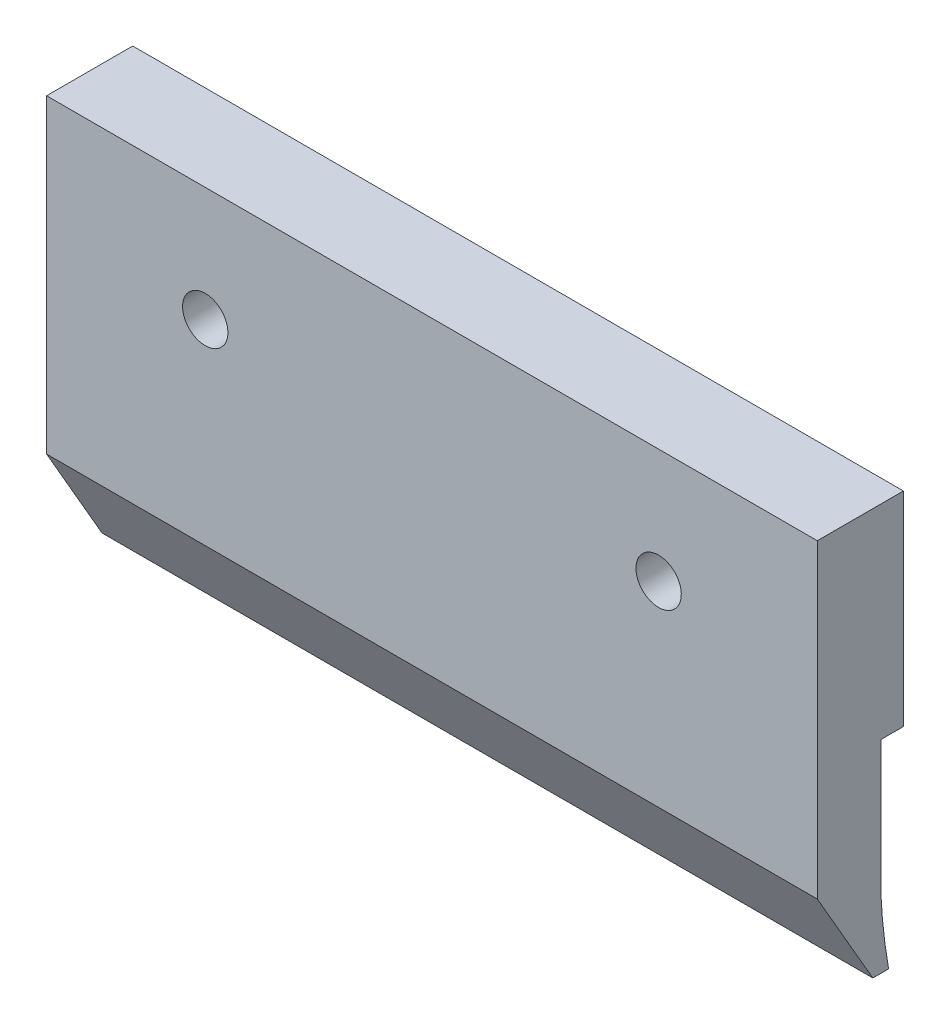
ISO-10303-21;
HEADER;
FILE_DESCRIPTION(('STEP AP214'),'2;1');
FILE_NAME('part.step','',(''),(''),'','','');
FILE_SCHEMA(('AUTOMOTIVE_DESIGN { 1 0 10303 214 1 1 1 1 }'));
ENDSEC;
DATA;
#1=APPLICATION_CONTEXT('core data for automotive mechanical design processes');
#2=APPLICATION_PROTOCOL_DEFINITION('international standard','automotive_design',2000,#1);
#3=PRODUCT_CONTEXT('',#1,'mechanical');
#4=PRODUCT('Part','Part','',(#3));
#5=PRODUCT_RELATED_PRODUCT_CATEGORY('part','',(#4));
#6=PRODUCT_DEFINITION_FORMATION('','',#4);
#7=PRODUCT_DEFINITION_CONTEXT('part definition',#1,'design');
#8=PRODUCT_DEFINITION('design','',#6,#7);
#9=PRODUCT_DEFINITION_SHAPE('','',#8);
#10=(LENGTH_UNIT() NAMED_UNIT(*) SI_UNIT(.MILLI.,.METRE.));
#11=(NAMED_UNIT(*) PLANE_ANGLE_UNIT() SI_UNIT($,.RADIAN.));
#12=(NAMED_UNIT(*) SI_UNIT($,.STERADIAN.) SOLID_ANGLE_UNIT());
#13=UNCERTAINTY_MEASURE_WITH_UNIT(LENGTH_MEASURE(1.E-05),#10,'distance_accuracy_value','');
#14=(GEOMETRIC_REPRESENTATION_CONTEXT(3) GLOBAL_UNCERTAINTY_ASSIGNED_CONTEXT((#13)) GLOBAL_UNIT_ASSIGNED_CONTEXT((#10,
#11,#12)) REPRESENTATION_CONTEXT('',''));
#15=CARTESIAN_POINT('',(0.,0.,0.));
#16=DIRECTION('',(0.,0.,1.));
#17=DIRECTION('',(1.,0.,0.));
#18=AXIS2_PLACEMENT_3D('',#15,#16,#17);
#19=CARTESIAN_POINT('',(-17.,0.,2.8));
#20=DIRECTION('',(0.,0.,1.));
#21=DIRECTION('',(0.,-1.,0.));
#22=AXIS2_PLACEMENT_3D('',#19,#20,#21);
#23=PLANE('',#22);
#24=CARTESIAN_POINT('',(-10.,3.95,2.8));
#25=DIRECTION('',(0.,0.,1.));
#26=DIRECTION('',(0.,-1.,0.));
#27=AXIS2_PLACEMENT_3D('',#24,#25,#26);
#28=CIRCLE('',#27,1.);
#29=CARTESIAN_POINT('',(-10.,2.95,2.8));
#30=VERTEX_POINT('',#29);
#31=EDGE_CURVE('E136',#30,#30,#28,.F.);
#32=ORIENTED_EDGE('',*,*,#31,.T.);
#33=EDGE_LOOP('',(#32));
#34=FACE_BOUND('',#33,.T.);
#35=DIRECTION('',(1.,0.,0.));
#36=VECTOR('',#35,1.);
#37=CARTESIAN_POINT('',(-17.,-4.68916910401132,2.8));
#38=LINE('',#37,#36);
#39=CARTESIAN_POINT('',(-17.,-4.68916910401132,2.8));
#40=VERTEX_POINT('',#39);
#41=CARTESIAN_POINT('',(17.,-4.68916910401132,2.8));
#42=VERTEX_POINT('',#41);
#43=EDGE_CURVE('E235',#40,#42,#38,.T.);
#44=ORIENTED_EDGE('',*,*,#43,.T.);
#45=DIRECTION('',(0.,-1.,0.));
#46=VECTOR('',#45,1.);
#47=CARTESIAN_POINT('',(17.,9.,2.8));
#48=LINE('',#47,#46);
#49=CARTESIAN_POINT('',(17.,9.,2.8));
#50=VERTEX_POINT('',#49);
#51=EDGE_CURVE('E146',#50,#42,#48,.T.);
#52=ORIENTED_EDGE('',*,*,#51,.F.);
#53=DIRECTION('',(1.,0.,0.));
#54=VECTOR('',#53,1.);
#55=CARTESIAN_POINT('',(-17.,9.,2.8));
#56=LINE('',#55,#54);
#57=CARTESIAN_POINT('',(-17.,9.,2.8));
#58=VERTEX_POINT('',#57);
#59=EDGE_CURVE('E240',#58,#50,#56,.T.);
#60=ORIENTED_EDGE('',*,*,#59,.F.);
#61=DIRECTION('',(0.,-1.,0.));
#62=VECTOR('',#61,1.);
#63=CARTESIAN_POINT('',(-17.,9.,2.8));
#64=LINE('',#63,#62);
#65=EDGE_CURVE('E177',#58,#40,#64,.T.);
#66=ORIENTED_EDGE('',*,*,#65,.T.);
#67=EDGE_LOOP('',(#44,#52,#60,#66));
#68=FACE_BOUND('',#67,.T.);
#69=CARTESIAN_POINT('',(10.,3.95,2.8));
#70=DIRECTION('',(0.,0.,1.));
#71=DIRECTION('',(0.,-1.,0.));
#72=AXIS2_PLACEMENT_3D('',#69,#70,#71);
#73=CIRCLE('',#72,1.);
#74=CARTESIAN_POINT('',(10.,2.95,2.8));
#75=VERTEX_POINT('',#74);
#76=EDGE_CURVE('E132',#75,#75,#73,.T.);
#77=ORIENTED_EDGE('',*,*,#76,.F.);
#78=EDGE_LOOP('',(#77));
#79=FACE_BOUND('',#78,.T.);
#80=ADVANCED_FACE('F43',(#34,#68,#79),#23,.T.);
#81=CARTESIAN_POINT('',(-17.,0.,-1.));
#82=DIRECTION('',(0.,0.,-1.));
#83=DIRECTION('',(-1.,0.,0.));
#84=AXIS2_PLACEMENT_3D('',#81,#82,#83);
#85=PLANE('',#84);
#86=CARTESIAN_POINT('',(-10.,3.95,-1.));
#87=DIRECTION('',(0.,0.,-1.));
#88=DIRECTION('',(-1.,0.,0.));
#89=AXIS2_PLACEMENT_3D('',#86,#87,#88);
#90=CIRCLE('',#89,1.);
#91=CARTESIAN_POINT('',(-11.,3.95,-1.));
#92=VERTEX_POINT('',#91);
#93=EDGE_CURVE('E267',#92,#92,#90,.F.);
#94=ORIENTED_EDGE('',*,*,#93,.T.);
#95=EDGE_LOOP('',(#94));
#96=FACE_BOUND('',#95,.T.);
#97=DIRECTION('',(1.,0.,0.));
#98=VECTOR('',#97,1.);
#99=CARTESIAN_POINT('',(-17.,9.,-1.));
#100=LINE('',#99,#98);
#101=CARTESIAN_POINT('',(-17.,9.,-1.));
#102=VERTEX_POINT('',#101);
#103=CARTESIAN_POINT('',(17.,9.,-1.));
#104=VERTEX_POINT('',#103);
#105=EDGE_CURVE('E243',#102,#104,#100,.T.);
#106=ORIENTED_EDGE('',*,*,#105,.T.);
#107=DIRECTION('',(0.,1.,0.));
#108=VECTOR('',#107,1.);
#109=CARTESIAN_POINT('',(17.,0.,-1.));
#110=LINE('',#109,#108);
#111=CARTESIAN_POINT('',(17.,0.,-1.));
#112=VERTEX_POINT('',#111);
#113=EDGE_CURVE('E124',#112,#104,#110,.T.);
#114=ORIENTED_EDGE('',*,*,#113,.F.);
#115=DIRECTION('',(1.,0.,0.));
#116=VECTOR('',#115,1.);
#117=CARTESIAN_POINT('',(-17.,0.,-1.));
#118=LINE('',#117,#116);
#119=CARTESIAN_POINT('',(-17.,0.,-1.));
#120=VERTEX_POINT('',#119);
#121=EDGE_CURVE('E115',#120,#112,#118,.T.);
#122=ORIENTED_EDGE('',*,*,#121,.F.);
#123=DIRECTION('',(0.,1.,0.));
#124=VECTOR('',#123,1.);
#125=CARTESIAN_POINT('',(-17.,0.,-1.));
#126=LINE('',#125,#124);
#127=EDGE_CURVE('E169',#120,#102,#126,.T.);
#128=ORIENTED_EDGE('',*,*,#127,.T.);
#129=EDGE_LOOP('',(#106,#114,#122,#128));
#130=FACE_BOUND('',#129,.T.);
#131=CARTESIAN_POINT('',(10.,3.95,-1.));
#132=DIRECTION('',(0.,0.,-1.));
#133=DIRECTION('',(-1.,0.,0.));
#134=AXIS2_PLACEMENT_3D('',#131,#132,#133);
#135=CIRCLE('',#134,1.);
#136=CARTESIAN_POINT('',(9.,3.95,-1.));
#137=VERTEX_POINT('',#136);
#138=EDGE_CURVE('E265',#137,#137,#135,.T.);
#139=ORIENTED_EDGE('',*,*,#138,.F.);
#140=EDGE_LOOP('',(#139));
#141=FACE_BOUND('',#140,.T.);
#142=ADVANCED_FACE('F213',(#96,#130,#141),#85,.T.);
#143=CARTESIAN_POINT('',(-17.,0.,0.));
#144=DIRECTION('',(0.,0.,-1.));
#145=DIRECTION('',(0.,1.,0.));
#146=AXIS2_PLACEMENT_3D('',#143,#144,#145);
#147=PLANE('',#146);
#148=DIRECTION('',(1.,0.,0.));
#149=VECTOR('',#148,1.);
#150=CARTESIAN_POINT('',(-17.,0.,0.));
#151=LINE('',#150,#149);
#152=CARTESIAN_POINT('',(-17.,0.,0.));
#153=VERTEX_POINT('',#152);
#154=CARTESIAN_POINT('',(17.,0.,0.));
#155=VERTEX_POINT('',#154);
#156=EDGE_CURVE('E47',#153,#155,#151,.T.);
#157=ORIENTED_EDGE('',*,*,#156,.T.);
#158=DIRECTION('',(0.,1.,0.));
#159=VECTOR('',#158,1.);
#160=CARTESIAN_POINT('',(17.,0.,0.));
#161=LINE('',#160,#159);
#162=CARTESIAN_POINT('',(17.,-5.78486106184396,0.));
#163=VERTEX_POINT('',#162);
#164=EDGE_CURVE('E109',#163,#155,#161,.T.);
#165=ORIENTED_EDGE('',*,*,#164,.F.);
#166=DIRECTION('',(1.,0.,0.));
#167=VECTOR('',#166,1.);
#168=CARTESIAN_POINT('',(-17.,-5.78486106184396,0.));
#169=LINE('',#168,#167);
#170=CARTESIAN_POINT('',(-17.,-5.78486106184396,0.));
#171=VERTEX_POINT('',#170);
#172=EDGE_CURVE('E11',#171,#163,#169,.T.);
#173=ORIENTED_EDGE('',*,*,#172,.F.);
#174=DIRECTION('',(0.,1.,0.));
#175=VECTOR('',#174,1.);
#176=CARTESIAN_POINT('',(-17.,0.,0.));
#177=LINE('',#176,#175);
#178=EDGE_CURVE('E110',#171,#153,#177,.T.);
#179=ORIENTED_EDGE('',*,*,#178,.T.);
#180=EDGE_LOOP('',(#157,#165,#173,#179));
#181=FACE_BOUND('',#180,.T.);
#182=ADVANCED_FACE('F45',(#181),#147,.T.);
#183=CARTESIAN_POINT('',(-17.,-8.93063917016291,-0.346500000000001));
#184=CARTESIAN_POINT('',(-17.,-7.36932915631329,-0.0681273570852772));
#185=CARTESIAN_POINT('',(-17.,-5.78486106184396,0.));
#186=B_SPLINE_CURVE_WITH_KNOTS('',2,(#183,#184,#185),.UNSPECIFIED.,.F.,.F.,(3,3),(0.,1.),.UNSPECIFIED.);
#187=DIRECTION('',(1.,0.,0.));
#188=VECTOR('',#187,1.);
#189=SURFACE_OF_LINEAR_EXTRUSION('',#186,#188);
#190=ORIENTED_EDGE('',*,*,#172,.T.);
#191=CARTESIAN_POINT('',(17.,-8.93063917016291,-0.346500000000001));
#192=CARTESIAN_POINT('',(17.,-7.36932915631329,-0.0681273570852772));
#193=CARTESIAN_POINT('',(17.,-5.78486106184396,0.));
#194=B_SPLINE_CURVE_WITH_KNOTS('',2,(#191,#192,#193),.UNSPECIFIED.,.F.,.F.,(3,3),(0.,1.),.UNSPECIFIED.);
#195=CARTESIAN_POINT('',(17.,-8.9306391701629,-0.346500000000001));
#196=VERTEX_POINT('',#195);
#197=EDGE_CURVE('E130',#196,#163,#194,.T.);
#198=ORIENTED_EDGE('',*,*,#197,.F.);
#199=DIRECTION('',(1.,0.,0.));
#200=VECTOR('',#199,1.);
#201=CARTESIAN_POINT('',(-17.,-8.9306391701629,-0.346500000000001));
#202=LINE('',#201,#200);
#203=CARTESIAN_POINT('',(-17.,-8.9306391701629,-0.346500000000001));
#204=VERTEX_POINT('',#203);
#205=EDGE_CURVE('E53',#204,#196,#202,.T.);
#206=ORIENTED_EDGE('',*,*,#205,.F.);
#207=EDGE_CURVE('E116',#204,#171,#186,.T.);
#208=ORIENTED_EDGE('',*,*,#207,.T.);
#209=EDGE_LOOP('',(#190,#198,#206,#208));
#210=FACE_BOUND('',#209,.T.);
#211=ADVANCED_FACE('F196',(#210),#189,.T.);
#212=CARTESIAN_POINT('',(-17.,-8.9306391701629,0.));
#213=DIRECTION('',(0.,-1.,0.));
#214=DIRECTION('',(0.,0.,-1.));
#215=AXIS2_PLACEMENT_3D('',#212,#213,#214);
#216=PLANE('',#215);
#217=ORIENTED_EDGE('',*,*,#205,.T.);
#218=DIRECTION('',(0.,0.,-1.));
#219=VECTOR('',#218,1.);
#220=CARTESIAN_POINT('',(17.,-8.93063917016291,0.351186115547634));
#221=LINE('',#220,#219);
#222=CARTESIAN_POINT('',(17.,-8.93063917016291,0.351186115547634));
#223=VERTEX_POINT('',#222);
#224=EDGE_CURVE('E154',#223,#196,#221,.T.);
#225=ORIENTED_EDGE('',*,*,#224,.F.);
#226=DIRECTION('',(1.,0.,0.));
#227=VECTOR('',#226,1.);
#228=CARTESIAN_POINT('',(-17.,-8.93063917016291,0.351186115547634));
#229=LINE('',#228,#227);
#230=CARTESIAN_POINT('',(-17.,-8.93063917016291,0.351186115547634));
#231=VERTEX_POINT('',#230);
#232=EDGE_CURVE('E233',#231,#223,#229,.T.);
#233=ORIENTED_EDGE('',*,*,#232,.F.);
#234=DIRECTION('',(0.,0.,-1.));
#235=VECTOR('',#234,1.);
#236=CARTESIAN_POINT('',(-17.,-8.93063917016291,0.351186115547634));
#237=LINE('',#236,#235);
#238=EDGE_CURVE('E67',#231,#204,#237,.T.);
#239=ORIENTED_EDGE('',*,*,#238,.T.);
#240=EDGE_LOOP('',(#217,#225,#233,#239));
#241=FACE_BOUND('',#240,.T.);
#242=ADVANCED_FACE('F200',(#241),#216,.T.);
#243=CARTESIAN_POINT('',(-17.,-8.93063917016291,0.351186115547634));
#244=DIRECTION('',(0.,-0.5,0.866025403784439));
#245=DIRECTION('',(0.,-0.866025403784438,-0.5));
#246=AXIS2_PLACEMENT_3D('',#243,#244,#245);
#247=PLANE('',#246);
#248=ORIENTED_EDGE('',*,*,#232,.T.);
#249=DIRECTION('',(0.,-0.866025403784438,-0.5));
#250=VECTOR('',#249,1.);
#251=CARTESIAN_POINT('',(17.,-8.93063917016291,0.351186115547634));
#252=LINE('',#251,#250);
#253=EDGE_CURVE('E150',#42,#223,#252,.T.);
#254=ORIENTED_EDGE('',*,*,#253,.F.);
#255=ORIENTED_EDGE('',*,*,#43,.F.);
#256=DIRECTION('',(0.,-0.866025403784438,-0.5));
#257=VECTOR('',#256,1.);
#258=CARTESIAN_POINT('',(-17.,-8.93063917016291,0.351186115547634));
#259=LINE('',#258,#257);
#260=EDGE_CURVE('E180',#40,#231,#259,.T.);
#261=ORIENTED_EDGE('',*,*,#260,.T.);
#262=EDGE_LOOP('',(#248,#254,#255,#261));
#263=FACE_BOUND('',#262,.T.);
#264=ADVANCED_FACE('F206',(#263),#247,.T.);
#265=CARTESIAN_POINT('',(-17.,9.,-1.));
#266=DIRECTION('',(0.,1.,0.));
#267=DIRECTION('',(0.,0.,1.));
#268=AXIS2_PLACEMENT_3D('',#265,#266,#267);
#269=PLANE('',#268);
#270=ORIENTED_EDGE('',*,*,#59,.T.);
#271=DIRECTION('',(0.,0.,1.));
#272=VECTOR('',#271,1.);
#273=CARTESIAN_POINT('',(17.,9.,-1.));
#274=LINE('',#273,#272);
#275=EDGE_CURVE('E142',#104,#50,#274,.T.);
#276=ORIENTED_EDGE('',*,*,#275,.F.);
#277=ORIENTED_EDGE('',*,*,#105,.F.);
#278=DIRECTION('',(0.,0.,1.));
#279=VECTOR('',#278,1.);
#280=CARTESIAN_POINT('',(-17.,9.,-1.));
#281=LINE('',#280,#279);
#282=EDGE_CURVE('E173',#102,#58,#281,.T.);
#283=ORIENTED_EDGE('',*,*,#282,.T.);
#284=EDGE_LOOP('',(#270,#276,#277,#283));
#285=FACE_BOUND('',#284,.T.);
#286=ADVANCED_FACE('F209',(#285),#269,.T.);
#287=CARTESIAN_POINT('',(-17.,0.,0.));
#288=DIRECTION('',(0.,-1.,0.));
#289=DIRECTION('',(0.,0.,-1.));
#290=AXIS2_PLACEMENT_3D('',#287,#288,#289);
#291=PLANE('',#290);
#292=ORIENTED_EDGE('',*,*,#121,.T.);
#293=DIRECTION('',(0.,0.,-1.));
#294=VECTOR('',#293,1.);
#295=CARTESIAN_POINT('',(17.,0.,0.));
#296=LINE('',#295,#294);
#297=EDGE_CURVE('E118',#155,#112,#296,.T.);
#298=ORIENTED_EDGE('',*,*,#297,.F.);
#299=ORIENTED_EDGE('',*,*,#156,.F.);
#300=DIRECTION('',(0.,0.,-1.));
#301=VECTOR('',#300,1.);
#302=CARTESIAN_POINT('',(-17.,0.,0.));
#303=LINE('',#302,#301);
#304=EDGE_CURVE('E166',#153,#120,#303,.T.);
#305=ORIENTED_EDGE('',*,*,#304,.T.);
#306=EDGE_LOOP('',(#292,#298,#299,#305));
#307=FACE_BOUND('',#306,.T.);
#308=ADVANCED_FACE('F119',(#307),#291,.T.);
#309=CARTESIAN_POINT('',(-17.,-7.36353963615836,-0.120688678542639));
#310=DIRECTION('',(-1.,0.,0.));
#311=DIRECTION('',(0.,0.,1.));
#312=AXIS2_PLACEMENT_3D('',#309,#310,#311);
#313=PLANE('',#312);
#314=ORIENTED_EDGE('',*,*,#178,.F.);
#315=ORIENTED_EDGE('',*,*,#207,.F.);
#316=ORIENTED_EDGE('',*,*,#238,.F.);
#317=ORIENTED_EDGE('',*,*,#260,.F.);
#318=ORIENTED_EDGE('',*,*,#65,.F.);
#319=ORIENTED_EDGE('',*,*,#282,.F.);
#320=ORIENTED_EDGE('',*,*,#127,.F.);
#321=ORIENTED_EDGE('',*,*,#304,.F.);
#322=EDGE_LOOP('',(#314,#315,#316,#317,#318,#319,#320,#321));
#323=FACE_BOUND('',#322,.T.);
#324=ADVANCED_FACE('F202',(#323),#313,.T.);
#325=CARTESIAN_POINT('',(17.,-7.36353963615836,-0.120688678542639));
#326=DIRECTION('',(-1.,0.,0.));
#327=DIRECTION('',(0.,0.,1.));
#328=AXIS2_PLACEMENT_3D('',#325,#326,#327);
#329=PLANE('',#328);
#330=ORIENTED_EDGE('',*,*,#164,.T.);
#331=ORIENTED_EDGE('',*,*,#297,.T.);
#332=ORIENTED_EDGE('',*,*,#113,.T.);
#333=ORIENTED_EDGE('',*,*,#275,.T.);
#334=ORIENTED_EDGE('',*,*,#51,.T.);
#335=ORIENTED_EDGE('',*,*,#253,.T.);
#336=ORIENTED_EDGE('',*,*,#224,.T.);
#337=ORIENTED_EDGE('',*,*,#197,.T.);
#338=EDGE_LOOP('',(#330,#331,#332,#333,#334,#335,#336,#337));
#339=FACE_BOUND('',#338,.T.);
#340=ADVANCED_FACE('F127',(#339),#329,.F.);
#341=CARTESIAN_POINT('',(-10.,3.95,16.));
#342=DIRECTION('',(0.,0.,-1.));
#343=DIRECTION('',(-1.,0.,0.));
#344=AXIS2_PLACEMENT_3D('',#341,#342,#343);
#345=CYLINDRICAL_SURFACE('',#344,1.);
#346=ORIENTED_EDGE('',*,*,#31,.F.);
#347=EDGE_LOOP('',(#346));
#348=FACE_BOUND('',#347,.T.);
#349=ORIENTED_EDGE('',*,*,#93,.F.);
#350=EDGE_LOOP('',(#349));
#351=FACE_BOUND('',#350,.T.);
#352=ADVANCED_FACE('F228',(#348,#351),#345,.F.);
#353=CARTESIAN_POINT('',(10.,3.95,16.));
#354=DIRECTION('',(0.,0.,-1.));
#355=DIRECTION('',(-1.,0.,0.));
#356=AXIS2_PLACEMENT_3D('',#353,#354,#355);
#357=CYLINDRICAL_SURFACE('',#356,1.);
#358=ORIENTED_EDGE('',*,*,#76,.T.);
#359=EDGE_LOOP('',(#358));
#360=FACE_BOUND('',#359,.T.);
#361=ORIENTED_EDGE('',*,*,#138,.T.);
#362=EDGE_LOOP('',(#361));
#363=FACE_BOUND('',#362,.T.);
#364=ADVANCED_FACE('F259',(#360,#363),#357,.F.);
#365=CLOSED_SHELL('',(#80,#142,#182,#211,#242,#264,#286,#308,#324,#340,#352,#364));
#366=MANIFOLD_SOLID_BREP('B2',#365);
#367=ADVANCED_BREP_SHAPE_REPRESENTATION('',(#18,#366),#14);
#368=SHAPE_DEFINITION_REPRESENTATION(#9,#367);
ENDSEC;
END-ISO-10303-21;
